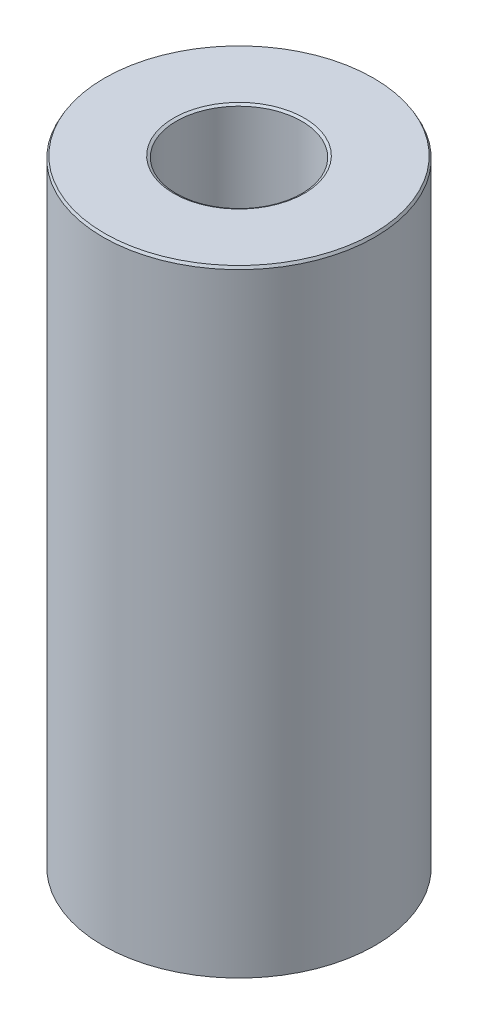
ISO-10303-21;
HEADER;
FILE_DESCRIPTION(('STEP AP214'),'2;1');
FILE_NAME('part.step','',(''),(''),'','','');
FILE_SCHEMA(('AUTOMOTIVE_DESIGN { 1 0 10303 214 1 1 1 1 }'));
ENDSEC;
DATA;
#1=APPLICATION_CONTEXT('core data for automotive mechanical design processes');
#2=APPLICATION_PROTOCOL_DEFINITION('international standard','automotive_design',2000,#1);
#3=PRODUCT_CONTEXT('',#1,'mechanical');
#4=PRODUCT('Part','Part','',(#3));
#5=PRODUCT_RELATED_PRODUCT_CATEGORY('part','',(#4));
#6=PRODUCT_DEFINITION_FORMATION('','',#4);
#7=PRODUCT_DEFINITION_CONTEXT('part definition',#1,'design');
#8=PRODUCT_DEFINITION('design','',#6,#7);
#9=PRODUCT_DEFINITION_SHAPE('','',#8);
#10=(LENGTH_UNIT() NAMED_UNIT(*) SI_UNIT(.MILLI.,.METRE.));
#11=(NAMED_UNIT(*) PLANE_ANGLE_UNIT() SI_UNIT($,.RADIAN.));
#12=(NAMED_UNIT(*) SI_UNIT($,.STERADIAN.) SOLID_ANGLE_UNIT());
#13=UNCERTAINTY_MEASURE_WITH_UNIT(LENGTH_MEASURE(1.E-05),#10,'distance_accuracy_value','');
#14=(GEOMETRIC_REPRESENTATION_CONTEXT(3) GLOBAL_UNCERTAINTY_ASSIGNED_CONTEXT((#13)) GLOBAL_UNIT_ASSIGNED_CONTEXT((#10,
#11,#12)) REPRESENTATION_CONTEXT('',''));
#15=CARTESIAN_POINT('',(0.,0.,0.));
#16=DIRECTION('',(0.,0.,1.));
#17=DIRECTION('',(1.,0.,0.));
#18=AXIS2_PLACEMENT_3D('',#15,#16,#17);
#19=CARTESIAN_POINT('',(0.,249.80298519435,0.));
#20=DIRECTION('',(0.,-1.,0.));
#21=DIRECTION('',(0.,0.,-1.));
#22=AXIS2_PLACEMENT_3D('',#19,#20,#21);
#23=CYLINDRICAL_SURFACE('',#22,55.);
#24=CARTESIAN_POINT('',(0.,0.599255474476812,0.));
#25=DIRECTION('',(0.,1.,0.));
#26=DIRECTION('',(0.,0.,1.));
#27=AXIS2_PLACEMENT_3D('',#24,#25,#26);
#28=CIRCLE('',#27,55.);
#29=CARTESIAN_POINT('',(0.,0.599255474476812,55.));
#30=VERTEX_POINT('',#29);
#31=EDGE_CURVE('E10',#30,#30,#28,.T.);
#32=ORIENTED_EDGE('',*,*,#31,.T.);
#33=EDGE_LOOP('',(#32));
#34=FACE_BOUND('',#33,.T.);
#35=CARTESIAN_POINT('',(0.,248.765044265842,0.));
#36=DIRECTION('',(0.,1.,0.));
#37=DIRECTION('',(0.,0.,1.));
#38=AXIS2_PLACEMENT_3D('',#35,#36,#37);
#39=CIRCLE('',#38,55.);
#40=CARTESIAN_POINT('',(0.,248.765044265842,55.));
#41=VERTEX_POINT('',#40);
#42=EDGE_CURVE('E50',#41,#41,#39,.F.);
#43=ORIENTED_EDGE('',*,*,#42,.T.);
#44=EDGE_LOOP('',(#43));
#45=FACE_BOUND('',#44,.T.);
#46=ADVANCED_FACE('F39',(#34,#45),#23,.T.);
#47=CARTESIAN_POINT('',(0.,249.80298519435,0.));
#48=DIRECTION('',(0.,1.,0.));
#49=DIRECTION('',(0.,0.,1.));
#50=AXIS2_PLACEMENT_3D('',#47,#48,#49);
#51=PLANE('',#50);
#52=CARTESIAN_POINT('',(0.,249.80298519435,0.));
#53=DIRECTION('',(0.,1.,0.));
#54=DIRECTION('',(0.,0.,1.));
#55=AXIS2_PLACEMENT_3D('',#52,#53,#54);
#56=CIRCLE('',#55,26.4252835727388);
#57=CARTESIAN_POINT('',(0.,249.80298519435,26.4252835727388));
#58=VERTEX_POINT('',#57);
#59=EDGE_CURVE('E58',#58,#58,#56,.F.);
#60=ORIENTED_EDGE('',*,*,#59,.T.);
#61=EDGE_LOOP('',(#60));
#62=FACE_BOUND('',#61,.T.);
#63=CARTESIAN_POINT('',(0.,249.80298519435,0.));
#64=DIRECTION('',(0.,1.,0.));
#65=DIRECTION('',(0.,0.,1.));
#66=AXIS2_PLACEMENT_3D('',#63,#64,#65);
#67=CIRCLE('',#66,54.4007445255232);
#68=CARTESIAN_POINT('',(0.,249.80298519435,54.4007445255232));
#69=VERTEX_POINT('',#68);
#70=EDGE_CURVE('E61',#69,#69,#67,.T.);
#71=ORIENTED_EDGE('',*,*,#70,.T.);
#72=EDGE_LOOP('',(#71));
#73=FACE_BOUND('',#72,.T.);
#74=ADVANCED_FACE('F88',(#62,#73),#51,.T.);
#75=CARTESIAN_POINT('',(0.,0.,0.));
#76=DIRECTION('',(0.,1.,0.));
#77=DIRECTION('',(0.,0.,1.));
#78=AXIS2_PLACEMENT_3D('',#75,#76,#77);
#79=PLANE('',#78);
#80=CARTESIAN_POINT('',(0.,0.,0.));
#81=DIRECTION('',(0.,1.,0.));
#82=DIRECTION('',(0.,0.,1.));
#83=AXIS2_PLACEMENT_3D('',#80,#81,#82);
#84=CIRCLE('',#83,25.986598118708);
#85=CARTESIAN_POINT('',(0.,0.,25.986598118708));
#86=VERTEX_POINT('',#85);
#87=EDGE_CURVE('E51',#86,#86,#84,.T.);
#88=ORIENTED_EDGE('',*,*,#87,.T.);
#89=EDGE_LOOP('',(#88));
#90=FACE_BOUND('',#89,.T.);
#91=CARTESIAN_POINT('',(0.,0.,0.));
#92=DIRECTION('',(0.,1.,0.));
#93=DIRECTION('',(0.,0.,1.));
#94=AXIS2_PLACEMENT_3D('',#91,#92,#93);
#95=CIRCLE('',#94,53.9620590714923);
#96=CARTESIAN_POINT('',(0.,0.,53.9620590714923));
#97=VERTEX_POINT('',#96);
#98=EDGE_CURVE('E54',#97,#97,#95,.F.);
#99=ORIENTED_EDGE('',*,*,#98,.T.);
#100=EDGE_LOOP('',(#99));
#101=FACE_BOUND('',#100,.T.);
#102=ADVANCED_FACE('F83',(#90,#101),#79,.F.);
#103=CARTESIAN_POINT('',(0.,249.80298519435,0.));
#104=DIRECTION('',(0.,-1.,0.));
#105=DIRECTION('',(0.,0.,-1.));
#106=AXIS2_PLACEMENT_3D('',#103,#104,#105);
#107=CYLINDRICAL_SURFACE('',#106,25.3873426442312);
#108=CARTESIAN_POINT('',(0.,249.203729719873,0.));
#109=DIRECTION('',(0.,1.,0.));
#110=DIRECTION('',(0.,0.,1.));
#111=AXIS2_PLACEMENT_3D('',#108,#109,#110);
#112=CIRCLE('',#111,25.3873426442312);
#113=CARTESIAN_POINT('',(0.,249.203729719873,25.3873426442312));
#114=VERTEX_POINT('',#113);
#115=EDGE_CURVE('E67',#114,#114,#112,.T.);
#116=ORIENTED_EDGE('',*,*,#115,.T.);
#117=EDGE_LOOP('',(#116));
#118=FACE_BOUND('',#117,.T.);
#119=CARTESIAN_POINT('',(0.,1.03794092850767,0.));
#120=DIRECTION('',(0.,1.,0.));
#121=DIRECTION('',(0.,0.,1.));
#122=AXIS2_PLACEMENT_3D('',#119,#120,#121);
#123=CIRCLE('',#122,25.3873426442312);
#124=CARTESIAN_POINT('',(0.,1.03794092850767,25.3873426442312));
#125=VERTEX_POINT('',#124);
#126=EDGE_CURVE('E69',#125,#125,#123,.F.);
#127=ORIENTED_EDGE('',*,*,#126,.T.);
#128=EDGE_LOOP('',(#127));
#129=FACE_BOUND('',#128,.T.);
#130=ADVANCED_FACE('F71',(#118,#129),#107,.F.);
#131=CARTESIAN_POINT('',(0.,249.203729719873,0.));
#132=DIRECTION('',(0.,1.,0.));
#133=DIRECTION('',(0.,0.,1.));
#134=AXIS2_PLACEMENT_3D('',#131,#132,#133);
#135=CONICAL_SURFACE('',#134,25.3873426442312,1.0471975511966);
#136=ORIENTED_EDGE('',*,*,#59,.F.);
#137=EDGE_LOOP('',(#136));
#138=FACE_BOUND('',#137,.T.);
#139=ORIENTED_EDGE('',*,*,#115,.F.);
#140=EDGE_LOOP('',(#139));
#141=FACE_BOUND('',#140,.T.);
#142=ADVANCED_FACE('F77',(#138,#141),#135,.F.);
#143=CARTESIAN_POINT('',(0.,0.,0.));
#144=DIRECTION('',(0.,-1.,0.));
#145=DIRECTION('',(0.,0.,-1.));
#146=AXIS2_PLACEMENT_3D('',#143,#144,#145);
#147=CONICAL_SURFACE('',#146,25.986598118708,0.523598775598312);
#148=ORIENTED_EDGE('',*,*,#126,.F.);
#149=EDGE_LOOP('',(#148));
#150=FACE_BOUND('',#149,.T.);
#151=ORIENTED_EDGE('',*,*,#87,.F.);
#152=EDGE_LOOP('',(#151));
#153=FACE_BOUND('',#152,.T.);
#154=ADVANCED_FACE('F73',(#150,#153),#147,.F.);
#155=CARTESIAN_POINT('',(0.,0.599255474476812,0.));
#156=DIRECTION('',(0.,1.,0.));
#157=DIRECTION('',(0.,0.,1.));
#158=AXIS2_PLACEMENT_3D('',#155,#156,#157);
#159=CONICAL_SURFACE('',#158,55.,1.04719755119661);
#160=ORIENTED_EDGE('',*,*,#98,.F.);
#161=EDGE_LOOP('',(#160));
#162=FACE_BOUND('',#161,.T.);
#163=ORIENTED_EDGE('',*,*,#31,.F.);
#164=EDGE_LOOP('',(#163));
#165=FACE_BOUND('',#164,.T.);
#166=ADVANCED_FACE('F76',(#162,#165),#159,.T.);
#167=CARTESIAN_POINT('',(0.,249.80298519435,0.));
#168=DIRECTION('',(0.,-1.,0.));
#169=DIRECTION('',(0.,0.,-1.));
#170=AXIS2_PLACEMENT_3D('',#167,#168,#169);
#171=CONICAL_SURFACE('',#170,54.4007445255232,0.523598775598313);
#172=ORIENTED_EDGE('',*,*,#42,.F.);
#173=EDGE_LOOP('',(#172));
#174=FACE_BOUND('',#173,.T.);
#175=ORIENTED_EDGE('',*,*,#70,.F.);
#176=EDGE_LOOP('',(#175));
#177=FACE_BOUND('',#176,.T.);
#178=ADVANCED_FACE('F45',(#174,#177),#171,.T.);
#179=CLOSED_SHELL('',(#46,#74,#102,#130,#142,#154,#166,#178));
#180=MANIFOLD_SOLID_BREP('B2',#179);
#181=ADVANCED_BREP_SHAPE_REPRESENTATION('',(#18,#180),#14);
#182=SHAPE_DEFINITION_REPRESENTATION(#9,#181);
ENDSEC;
END-ISO-10303-21;
